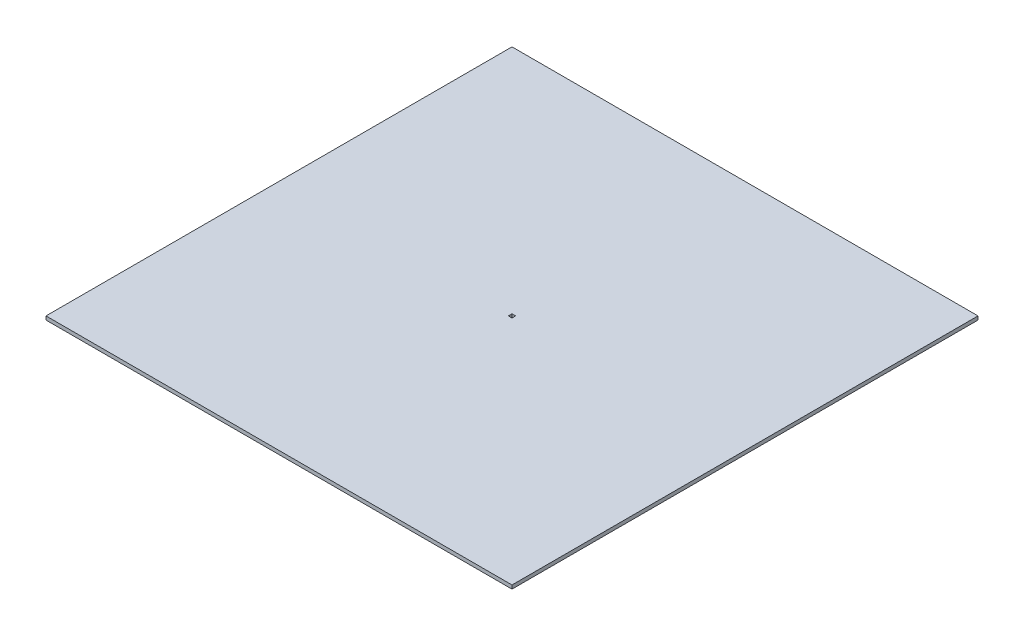
ISO-10303-21;
HEADER;
FILE_DESCRIPTION(('STEP AP214'),'2;1');
FILE_NAME('part.step','',(''),(''),'','','');
FILE_SCHEMA(('AUTOMOTIVE_DESIGN { 1 0 10303 214 1 1 1 1 }'));
ENDSEC;
DATA;
#1=APPLICATION_CONTEXT('core data for automotive mechanical design processes');
#2=APPLICATION_PROTOCOL_DEFINITION('international standard','automotive_design',2000,#1);
#3=PRODUCT_CONTEXT('',#1,'mechanical');
#4=PRODUCT('Part','Part','',(#3));
#5=PRODUCT_RELATED_PRODUCT_CATEGORY('part','',(#4));
#6=PRODUCT_DEFINITION_FORMATION('','',#4);
#7=PRODUCT_DEFINITION_CONTEXT('part definition',#1,'design');
#8=PRODUCT_DEFINITION('design','',#6,#7);
#9=PRODUCT_DEFINITION_SHAPE('','',#8);
#10=(LENGTH_UNIT() NAMED_UNIT(*) SI_UNIT(.MILLI.,.METRE.));
#11=(NAMED_UNIT(*) PLANE_ANGLE_UNIT() SI_UNIT($,.RADIAN.));
#12=(NAMED_UNIT(*) SI_UNIT($,.STERADIAN.) SOLID_ANGLE_UNIT());
#13=UNCERTAINTY_MEASURE_WITH_UNIT(LENGTH_MEASURE(1.E-05),#10,'distance_accuracy_value','');
#14=(GEOMETRIC_REPRESENTATION_CONTEXT(3) GLOBAL_UNCERTAINTY_ASSIGNED_CONTEXT((#13)) GLOBAL_UNIT_ASSIGNED_CONTEXT((#10,
#11,#12)) REPRESENTATION_CONTEXT('',''));
#15=CARTESIAN_POINT('',(0.,0.,0.));
#16=DIRECTION('',(0.,0.,1.));
#17=DIRECTION('',(1.,0.,0.));
#18=AXIS2_PLACEMENT_3D('',#15,#16,#17);
#19=CARTESIAN_POINT('',(0.,10.,0.));
#20=DIRECTION('',(0.,1.,0.));
#21=DIRECTION('',(0.,0.,1.));
#22=AXIS2_PLACEMENT_3D('',#19,#20,#21);
#23=PLANE('',#22);
#24=DIRECTION('',(0.,0.,1.));
#25=VECTOR('',#24,1.);
#26=CARTESIAN_POINT('',(-640.,10.,-640.));
#27=LINE('',#26,#25);
#28=CARTESIAN_POINT('',(-640.,10.,-640.));
#29=VERTEX_POINT('',#28);
#30=CARTESIAN_POINT('',(-640.,10.,640.));
#31=VERTEX_POINT('',#30);
#32=EDGE_CURVE('E135',#29,#31,#27,.T.);
#33=ORIENTED_EDGE('',*,*,#32,.T.);
#34=DIRECTION('',(1.,0.,0.));
#35=VECTOR('',#34,1.);
#36=CARTESIAN_POINT('',(-640.,10.,640.));
#37=LINE('',#36,#35);
#38=CARTESIAN_POINT('',(640.,10.,640.));
#39=VERTEX_POINT('',#38);
#40=EDGE_CURVE('E138',#31,#39,#37,.T.);
#41=ORIENTED_EDGE('',*,*,#40,.T.);
#42=DIRECTION('',(0.,0.,-1.));
#43=VECTOR('',#42,1.);
#44=CARTESIAN_POINT('',(640.,10.,-640.));
#45=LINE('',#44,#43);
#46=CARTESIAN_POINT('',(640.,10.,-640.));
#47=VERTEX_POINT('',#46);
#48=EDGE_CURVE('E141',#39,#47,#45,.T.);
#49=ORIENTED_EDGE('',*,*,#48,.T.);
#50=DIRECTION('',(-1.,0.,0.));
#51=VECTOR('',#50,1.);
#52=CARTESIAN_POINT('',(-640.,10.,-640.));
#53=LINE('',#52,#51);
#54=EDGE_CURVE('E143',#47,#29,#53,.T.);
#55=ORIENTED_EDGE('',*,*,#54,.T.);
#56=EDGE_LOOP('',(#33,#41,#49,#55));
#57=FACE_BOUND('',#56,.T.);
#58=DIRECTION('',(1.,0.,0.));
#59=VECTOR('',#58,1.);
#60=CARTESIAN_POINT('',(-5.,10.,5.));
#61=LINE('',#60,#59);
#62=CARTESIAN_POINT('',(-5.,10.,5.));
#63=VERTEX_POINT('',#62);
#64=CARTESIAN_POINT('',(5.,10.,5.));
#65=VERTEX_POINT('',#64);
#66=EDGE_CURVE('E107',#63,#65,#61,.T.);
#67=ORIENTED_EDGE('',*,*,#66,.F.);
#68=DIRECTION('',(0.,0.,1.));
#69=VECTOR('',#68,1.);
#70=CARTESIAN_POINT('',(-5.,10.,-5.));
#71=LINE('',#70,#69);
#72=CARTESIAN_POINT('',(-5.,10.,-5.));
#73=VERTEX_POINT('',#72);
#74=EDGE_CURVE('E99',#73,#63,#71,.T.);
#75=ORIENTED_EDGE('',*,*,#74,.F.);
#76=DIRECTION('',(-1.,0.,0.));
#77=VECTOR('',#76,1.);
#78=CARTESIAN_POINT('',(-5.,10.,-5.));
#79=LINE('',#78,#77);
#80=CARTESIAN_POINT('',(5.,10.,-5.));
#81=VERTEX_POINT('',#80);
#82=EDGE_CURVE('E121',#81,#73,#79,.T.);
#83=ORIENTED_EDGE('',*,*,#82,.F.);
#84=DIRECTION('',(0.,0.,-1.));
#85=VECTOR('',#84,1.);
#86=CARTESIAN_POINT('',(5.,10.,-5.));
#87=LINE('',#86,#85);
#88=EDGE_CURVE('E119',#65,#81,#87,.T.);
#89=ORIENTED_EDGE('',*,*,#88,.F.);
#90=EDGE_LOOP('',(#67,#75,#83,#89));
#91=FACE_BOUND('',#90,.T.);
#92=ADVANCED_FACE('F34',(#57,#91),#23,.T.);
#93=CARTESIAN_POINT('',(0.,0.,0.));
#94=DIRECTION('',(0.,1.,0.));
#95=DIRECTION('',(0.,0.,1.));
#96=AXIS2_PLACEMENT_3D('',#93,#94,#95);
#97=PLANE('',#96);
#98=DIRECTION('',(0.,0.,1.));
#99=VECTOR('',#98,1.);
#100=CARTESIAN_POINT('',(-640.,0.,-640.));
#101=LINE('',#100,#99);
#102=CARTESIAN_POINT('',(-640.,0.,-640.));
#103=VERTEX_POINT('',#102);
#104=CARTESIAN_POINT('',(-640.,0.,640.));
#105=VERTEX_POINT('',#104);
#106=EDGE_CURVE('E115',#103,#105,#101,.T.);
#107=ORIENTED_EDGE('',*,*,#106,.F.);
#108=DIRECTION('',(-1.,0.,0.));
#109=VECTOR('',#108,1.);
#110=CARTESIAN_POINT('',(-640.,0.,-640.));
#111=LINE('',#110,#109);
#112=CARTESIAN_POINT('',(640.,0.,-640.));
#113=VERTEX_POINT('',#112);
#114=EDGE_CURVE('E139',#113,#103,#111,.T.);
#115=ORIENTED_EDGE('',*,*,#114,.F.);
#116=DIRECTION('',(0.,0.,-1.));
#117=VECTOR('',#116,1.);
#118=CARTESIAN_POINT('',(640.,0.,-640.));
#119=LINE('',#118,#117);
#120=CARTESIAN_POINT('',(640.,0.,640.));
#121=VERTEX_POINT('',#120);
#122=EDGE_CURVE('E150',#121,#113,#119,.T.);
#123=ORIENTED_EDGE('',*,*,#122,.F.);
#124=DIRECTION('',(1.,0.,0.));
#125=VECTOR('',#124,1.);
#126=CARTESIAN_POINT('',(-640.,0.,640.));
#127=LINE('',#126,#125);
#128=EDGE_CURVE('E148',#105,#121,#127,.T.);
#129=ORIENTED_EDGE('',*,*,#128,.F.);
#130=EDGE_LOOP('',(#107,#115,#123,#129));
#131=FACE_BOUND('',#130,.T.);
#132=DIRECTION('',(0.,0.,1.));
#133=VECTOR('',#132,1.);
#134=CARTESIAN_POINT('',(-5.,0.,-5.));
#135=LINE('',#134,#133);
#136=CARTESIAN_POINT('',(-5.,0.,-5.));
#137=VERTEX_POINT('',#136);
#138=CARTESIAN_POINT('',(-5.,0.,5.));
#139=VERTEX_POINT('',#138);
#140=EDGE_CURVE('E57',#137,#139,#135,.T.);
#141=ORIENTED_EDGE('',*,*,#140,.T.);
#142=DIRECTION('',(1.,0.,0.));
#143=VECTOR('',#142,1.);
#144=CARTESIAN_POINT('',(-5.,0.,5.));
#145=LINE('',#144,#143);
#146=CARTESIAN_POINT('',(5.,0.,5.));
#147=VERTEX_POINT('',#146);
#148=EDGE_CURVE('E114',#139,#147,#145,.T.);
#149=ORIENTED_EDGE('',*,*,#148,.T.);
#150=DIRECTION('',(0.,0.,-1.));
#151=VECTOR('',#150,1.);
#152=CARTESIAN_POINT('',(5.,0.,-5.));
#153=LINE('',#152,#151);
#154=CARTESIAN_POINT('',(5.,0.,-5.));
#155=VERTEX_POINT('',#154);
#156=EDGE_CURVE('E127',#147,#155,#153,.T.);
#157=ORIENTED_EDGE('',*,*,#156,.T.);
#158=DIRECTION('',(-1.,0.,0.));
#159=VECTOR('',#158,1.);
#160=CARTESIAN_POINT('',(-5.,0.,-5.));
#161=LINE('',#160,#159);
#162=EDGE_CURVE('E108',#155,#137,#161,.T.);
#163=ORIENTED_EDGE('',*,*,#162,.T.);
#164=EDGE_LOOP('',(#141,#149,#157,#163));
#165=FACE_BOUND('',#164,.T.);
#166=ADVANCED_FACE('F168',(#131,#165),#97,.F.);
#167=CARTESIAN_POINT('',(-640.,10.,-640.));
#168=DIRECTION('',(1.,0.,0.));
#169=DIRECTION('',(0.,0.,-1.));
#170=AXIS2_PLACEMENT_3D('',#167,#168,#169);
#171=PLANE('',#170);
#172=ORIENTED_EDGE('',*,*,#106,.T.);
#173=DIRECTION('',(0.,-1.,0.));
#174=VECTOR('',#173,1.);
#175=CARTESIAN_POINT('',(-640.,10.,640.));
#176=LINE('',#175,#174);
#177=EDGE_CURVE('E11',#31,#105,#176,.T.);
#178=ORIENTED_EDGE('',*,*,#177,.F.);
#179=ORIENTED_EDGE('',*,*,#32,.F.);
#180=DIRECTION('',(0.,-1.,0.));
#181=VECTOR('',#180,1.);
#182=CARTESIAN_POINT('',(-640.,10.,-640.));
#183=LINE('',#182,#181);
#184=EDGE_CURVE('E145',#29,#103,#183,.T.);
#185=ORIENTED_EDGE('',*,*,#184,.T.);
#186=EDGE_LOOP('',(#172,#178,#179,#185));
#187=FACE_BOUND('',#186,.T.);
#188=ADVANCED_FACE('F36',(#187),#171,.F.);
#189=CARTESIAN_POINT('',(-640.,10.,640.));
#190=DIRECTION('',(0.,0.,-1.));
#191=DIRECTION('',(-1.,0.,0.));
#192=AXIS2_PLACEMENT_3D('',#189,#190,#191);
#193=PLANE('',#192);
#194=ORIENTED_EDGE('',*,*,#128,.T.);
#195=DIRECTION('',(0.,-1.,0.));
#196=VECTOR('',#195,1.);
#197=CARTESIAN_POINT('',(640.,10.,640.));
#198=LINE('',#197,#196);
#199=EDGE_CURVE('E42',#39,#121,#198,.T.);
#200=ORIENTED_EDGE('',*,*,#199,.F.);
#201=ORIENTED_EDGE('',*,*,#40,.F.);
#202=ORIENTED_EDGE('',*,*,#177,.T.);
#203=EDGE_LOOP('',(#194,#200,#201,#202));
#204=FACE_BOUND('',#203,.T.);
#205=ADVANCED_FACE('F178',(#204),#193,.F.);
#206=CARTESIAN_POINT('',(640.,10.,-640.));
#207=DIRECTION('',(-1.,0.,0.));
#208=DIRECTION('',(0.,0.,1.));
#209=AXIS2_PLACEMENT_3D('',#206,#207,#208);
#210=PLANE('',#209);
#211=ORIENTED_EDGE('',*,*,#122,.T.);
#212=DIRECTION('',(0.,-1.,0.));
#213=VECTOR('',#212,1.);
#214=CARTESIAN_POINT('',(640.,10.,-640.));
#215=LINE('',#214,#213);
#216=EDGE_CURVE('E155',#47,#113,#215,.T.);
#217=ORIENTED_EDGE('',*,*,#216,.F.);
#218=ORIENTED_EDGE('',*,*,#48,.F.);
#219=ORIENTED_EDGE('',*,*,#199,.T.);
#220=EDGE_LOOP('',(#211,#217,#218,#219));
#221=FACE_BOUND('',#220,.T.);
#222=ADVANCED_FACE('F162',(#221),#210,.F.);
#223=CARTESIAN_POINT('',(-640.,10.,-640.));
#224=DIRECTION('',(0.,0.,1.));
#225=DIRECTION('',(1.,0.,0.));
#226=AXIS2_PLACEMENT_3D('',#223,#224,#225);
#227=PLANE('',#226);
#228=ORIENTED_EDGE('',*,*,#114,.T.);
#229=ORIENTED_EDGE('',*,*,#184,.F.);
#230=ORIENTED_EDGE('',*,*,#54,.F.);
#231=ORIENTED_EDGE('',*,*,#216,.T.);
#232=EDGE_LOOP('',(#228,#229,#230,#231));
#233=FACE_BOUND('',#232,.T.);
#234=ADVANCED_FACE('F172',(#233),#227,.F.);
#235=CARTESIAN_POINT('',(-5.,10.,-5.));
#236=DIRECTION('',(1.,0.,0.));
#237=DIRECTION('',(0.,0.,-1.));
#238=AXIS2_PLACEMENT_3D('',#235,#236,#237);
#239=PLANE('',#238);
#240=ORIENTED_EDGE('',*,*,#140,.F.);
#241=DIRECTION('',(0.,-1.,0.));
#242=VECTOR('',#241,1.);
#243=CARTESIAN_POINT('',(-5.,10.,-5.));
#244=LINE('',#243,#242);
#245=EDGE_CURVE('E103',#73,#137,#244,.T.);
#246=ORIENTED_EDGE('',*,*,#245,.F.);
#247=ORIENTED_EDGE('',*,*,#74,.T.);
#248=DIRECTION('',(0.,-1.,0.));
#249=VECTOR('',#248,1.);
#250=CARTESIAN_POINT('',(-5.,10.,5.));
#251=LINE('',#250,#249);
#252=EDGE_CURVE('E102',#63,#139,#251,.T.);
#253=ORIENTED_EDGE('',*,*,#252,.T.);
#254=EDGE_LOOP('',(#240,#246,#247,#253));
#255=FACE_BOUND('',#254,.T.);
#256=ADVANCED_FACE('F101',(#255),#239,.T.);
#257=CARTESIAN_POINT('',(-5.,10.,5.));
#258=DIRECTION('',(0.,0.,-1.));
#259=DIRECTION('',(-1.,0.,0.));
#260=AXIS2_PLACEMENT_3D('',#257,#258,#259);
#261=PLANE('',#260);
#262=ORIENTED_EDGE('',*,*,#148,.F.);
#263=ORIENTED_EDGE('',*,*,#252,.F.);
#264=ORIENTED_EDGE('',*,*,#66,.T.);
#265=DIRECTION('',(0.,-1.,0.));
#266=VECTOR('',#265,1.);
#267=CARTESIAN_POINT('',(5.,10.,5.));
#268=LINE('',#267,#266);
#269=EDGE_CURVE('E116',#65,#147,#268,.T.);
#270=ORIENTED_EDGE('',*,*,#269,.T.);
#271=EDGE_LOOP('',(#262,#263,#264,#270));
#272=FACE_BOUND('',#271,.T.);
#273=ADVANCED_FACE('F111',(#272),#261,.T.);
#274=CARTESIAN_POINT('',(5.,10.,-5.));
#275=DIRECTION('',(-1.,0.,0.));
#276=DIRECTION('',(0.,0.,1.));
#277=AXIS2_PLACEMENT_3D('',#274,#275,#276);
#278=PLANE('',#277);
#279=ORIENTED_EDGE('',*,*,#156,.F.);
#280=ORIENTED_EDGE('',*,*,#269,.F.);
#281=ORIENTED_EDGE('',*,*,#88,.T.);
#282=DIRECTION('',(0.,-1.,0.));
#283=VECTOR('',#282,1.);
#284=CARTESIAN_POINT('',(5.,10.,-5.));
#285=LINE('',#284,#283);
#286=EDGE_CURVE('E49',#81,#155,#285,.T.);
#287=ORIENTED_EDGE('',*,*,#286,.T.);
#288=EDGE_LOOP('',(#279,#280,#281,#287));
#289=FACE_BOUND('',#288,.T.);
#290=ADVANCED_FACE('F201',(#289),#278,.T.);
#291=CARTESIAN_POINT('',(-5.,10.,-5.));
#292=DIRECTION('',(0.,0.,1.));
#293=DIRECTION('',(1.,0.,0.));
#294=AXIS2_PLACEMENT_3D('',#291,#292,#293);
#295=PLANE('',#294);
#296=ORIENTED_EDGE('',*,*,#162,.F.);
#297=ORIENTED_EDGE('',*,*,#286,.F.);
#298=ORIENTED_EDGE('',*,*,#82,.T.);
#299=ORIENTED_EDGE('',*,*,#245,.T.);
#300=EDGE_LOOP('',(#296,#297,#298,#299));
#301=FACE_BOUND('',#300,.T.);
#302=ADVANCED_FACE('F205',(#301),#295,.T.);
#303=CLOSED_SHELL('',(#92,#166,#188,#205,#222,#234,#256,#273,#290,#302));
#304=MANIFOLD_SOLID_BREP('B2',#303);
#305=ADVANCED_BREP_SHAPE_REPRESENTATION('',(#18,#304),#14);
#306=SHAPE_DEFINITION_REPRESENTATION(#9,#305);
ENDSEC;
END-ISO-10303-21;
